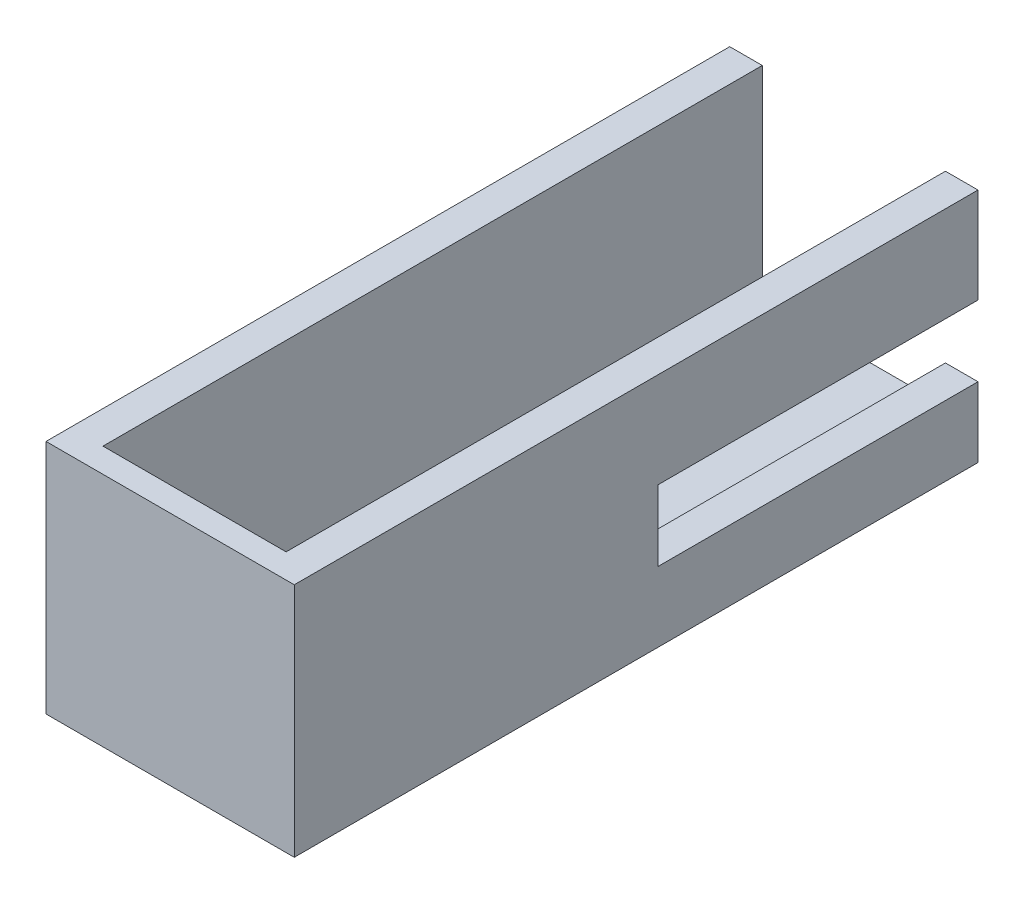
ISO-10303-21;
HEADER;
FILE_DESCRIPTION(('STEP AP214'),'2;1');
FILE_NAME('part.step','',(''),(''),'','','');
FILE_SCHEMA(('AUTOMOTIVE_DESIGN { 1 0 10303 214 1 1 1 1 }'));
ENDSEC;
DATA;
#1=APPLICATION_CONTEXT('core data for automotive mechanical design processes');
#2=APPLICATION_PROTOCOL_DEFINITION('international standard','automotive_design',2000,#1);
#3=PRODUCT_CONTEXT('',#1,'mechanical');
#4=PRODUCT('Part','Part','',(#3));
#5=PRODUCT_RELATED_PRODUCT_CATEGORY('part','',(#4));
#6=PRODUCT_DEFINITION_FORMATION('','',#4);
#7=PRODUCT_DEFINITION_CONTEXT('part definition',#1,'design');
#8=PRODUCT_DEFINITION('design','',#6,#7);
#9=PRODUCT_DEFINITION_SHAPE('','',#8);
#10=(LENGTH_UNIT() NAMED_UNIT(*) SI_UNIT(.MILLI.,.METRE.));
#11=(NAMED_UNIT(*) PLANE_ANGLE_UNIT() SI_UNIT($,.RADIAN.));
#12=(NAMED_UNIT(*) SI_UNIT($,.STERADIAN.) SOLID_ANGLE_UNIT());
#13=UNCERTAINTY_MEASURE_WITH_UNIT(LENGTH_MEASURE(1.E-05),#10,'distance_accuracy_value','');
#14=(GEOMETRIC_REPRESENTATION_CONTEXT(3) GLOBAL_UNCERTAINTY_ASSIGNED_CONTEXT((#13)) GLOBAL_UNIT_ASSIGNED_CONTEXT((#10,
#11,#12)) REPRESENTATION_CONTEXT('',''));
#15=CARTESIAN_POINT('',(0.,0.,0.));
#16=DIRECTION('',(0.,0.,1.));
#17=DIRECTION('',(1.,0.,0.));
#18=AXIS2_PLACEMENT_3D('',#15,#16,#17);
#19=CARTESIAN_POINT('',(12.6513513513514,-25.,42.));
#20=DIRECTION('',(1.,0.,0.));
#21=DIRECTION('',(0.,0.,-1.));
#22=AXIS2_PLACEMENT_3D('',#19,#20,#21);
#23=PLANE('',#22);
#24=DIRECTION('',(0.,0.,-1.));
#25=VECTOR('',#24,1.);
#26=CARTESIAN_POINT('',(12.6513513513514,-11.7079955572935,42.));
#27=LINE('',#26,#25);
#28=CARTESIAN_POINT('',(12.6513513513514,-11.7079955572935,-2.65905185019667));
#29=VERTEX_POINT('',#28);
#30=CARTESIAN_POINT('',(12.6513513513514,-11.7079955572935,-42.));
#31=VERTEX_POINT('',#30);
#32=EDGE_CURVE('E166',#29,#31,#27,.T.);
#33=ORIENTED_EDGE('',*,*,#32,.F.);
#34=DIRECTION('',(0.,1.,0.));
#35=VECTOR('',#34,1.);
#36=CARTESIAN_POINT('',(12.6513513513514,-25.,-2.65905185019667));
#37=LINE('',#36,#35);
#38=CARTESIAN_POINT('',(12.6513513513514,-20.3979955572935,-2.65905185019667));
#39=VERTEX_POINT('',#38);
#40=EDGE_CURVE('E169',#39,#29,#37,.T.);
#41=ORIENTED_EDGE('',*,*,#40,.F.);
#42=DIRECTION('',(0.,0.,1.));
#43=VECTOR('',#42,1.);
#44=CARTESIAN_POINT('',(12.6513513513514,-20.3979955572935,42.));
#45=LINE('',#44,#43);
#46=CARTESIAN_POINT('',(12.6513513513514,-20.3979955572935,-42.));
#47=VERTEX_POINT('',#46);
#48=EDGE_CURVE('E149',#47,#39,#45,.T.);
#49=ORIENTED_EDGE('',*,*,#48,.F.);
#50=DIRECTION('',(0.,-1.,0.));
#51=VECTOR('',#50,1.);
#52=CARTESIAN_POINT('',(12.6513513513514,-25.,-42.));
#53=LINE('',#52,#51);
#54=CARTESIAN_POINT('',(12.6513513513514,-25.,-42.));
#55=VERTEX_POINT('',#54);
#56=EDGE_CURVE('E210',#47,#55,#53,.T.);
#57=ORIENTED_EDGE('',*,*,#56,.T.);
#58=DIRECTION('',(0.,0.,-1.));
#59=VECTOR('',#58,1.);
#60=CARTESIAN_POINT('',(12.6513513513514,-25.,42.));
#61=LINE('',#60,#59);
#62=CARTESIAN_POINT('',(12.6513513513514,-25.,39.));
#63=VERTEX_POINT('',#62);
#64=EDGE_CURVE('E226',#63,#55,#61,.T.);
#65=ORIENTED_EDGE('',*,*,#64,.F.);
#66=DIRECTION('',(0.,-1.,0.));
#67=VECTOR('',#66,1.);
#68=CARTESIAN_POINT('',(12.6513513513514,-25.,39.));
#69=LINE('',#68,#67);
#70=CARTESIAN_POINT('',(12.6513513513514,0.,39.));
#71=VERTEX_POINT('',#70);
#72=EDGE_CURVE('E178',#71,#63,#69,.T.);
#73=ORIENTED_EDGE('',*,*,#72,.F.);
#74=DIRECTION('',(0.,0.,-1.));
#75=VECTOR('',#74,1.);
#76=CARTESIAN_POINT('',(12.6513513513514,0.,42.));
#77=LINE('',#76,#75);
#78=CARTESIAN_POINT('',(12.6513513513514,0.,-42.));
#79=VERTEX_POINT('',#78);
#80=EDGE_CURVE('E230',#71,#79,#77,.T.);
#81=ORIENTED_EDGE('',*,*,#80,.T.);
#82=EDGE_CURVE('E211',#79,#31,#53,.T.);
#83=ORIENTED_EDGE('',*,*,#82,.T.);
#84=EDGE_LOOP('',(#33,#41,#49,#57,#65,#73,#81,#83));
#85=FACE_BOUND('',#84,.T.);
#86=ADVANCED_FACE('F39',(#85),#23,.F.);
#87=CARTESIAN_POINT('',(16.6513513513514,0.,42.));
#88=DIRECTION('',(-1.,0.,0.));
#89=DIRECTION('',(0.,-1.,0.));
#90=AXIS2_PLACEMENT_3D('',#87,#88,#89);
#91=PLANE('',#90);
#92=DIRECTION('',(0.,0.,1.));
#93=VECTOR('',#92,1.);
#94=CARTESIAN_POINT('',(16.6513513513514,-11.7079955572935,42.));
#95=LINE('',#94,#93);
#96=CARTESIAN_POINT('',(16.6513513513514,-11.7079955572935,-42.));
#97=VERTEX_POINT('',#96);
#98=CARTESIAN_POINT('',(16.6513513513514,-11.7079955572935,-2.65905185019667));
#99=VERTEX_POINT('',#98);
#100=EDGE_CURVE('E160',#97,#99,#95,.T.);
#101=ORIENTED_EDGE('',*,*,#100,.F.);
#102=DIRECTION('',(0.,1.,0.));
#103=VECTOR('',#102,1.);
#104=CARTESIAN_POINT('',(16.6513513513514,0.,-42.));
#105=LINE('',#104,#103);
#106=CARTESIAN_POINT('',(16.6513513513514,0.,-42.));
#107=VERTEX_POINT('',#106);
#108=EDGE_CURVE('E203',#97,#107,#105,.T.);
#109=ORIENTED_EDGE('',*,*,#108,.T.);
#110=DIRECTION('',(0.,0.,-1.));
#111=VECTOR('',#110,1.);
#112=CARTESIAN_POINT('',(16.6513513513514,0.,42.));
#113=LINE('',#112,#111);
#114=CARTESIAN_POINT('',(16.6513513513514,0.,42.));
#115=VERTEX_POINT('',#114);
#116=EDGE_CURVE('E233',#115,#107,#113,.T.);
#117=ORIENTED_EDGE('',*,*,#116,.F.);
#118=DIRECTION('',(0.,1.,0.));
#119=VECTOR('',#118,1.);
#120=CARTESIAN_POINT('',(16.6513513513514,0.,42.));
#121=LINE('',#120,#119);
#122=CARTESIAN_POINT('',(16.6513513513514,-29.,42.));
#123=VERTEX_POINT('',#122);
#124=EDGE_CURVE('E190',#123,#115,#121,.T.);
#125=ORIENTED_EDGE('',*,*,#124,.F.);
#126=DIRECTION('',(0.,0.,-1.));
#127=VECTOR('',#126,1.);
#128=CARTESIAN_POINT('',(16.6513513513514,-29.,42.));
#129=LINE('',#128,#127);
#130=CARTESIAN_POINT('',(16.6513513513514,-29.,-42.));
#131=VERTEX_POINT('',#130);
#132=EDGE_CURVE('E236',#123,#131,#129,.T.);
#133=ORIENTED_EDGE('',*,*,#132,.T.);
#134=CARTESIAN_POINT('',(16.6513513513514,-20.3979955572935,-42.));
#135=VERTEX_POINT('',#134);
#136=EDGE_CURVE('E155',#131,#135,#105,.T.);
#137=ORIENTED_EDGE('',*,*,#136,.T.);
#138=DIRECTION('',(0.,0.,-1.));
#139=VECTOR('',#138,1.);
#140=CARTESIAN_POINT('',(16.6513513513514,-20.3979955572935,42.));
#141=LINE('',#140,#139);
#142=CARTESIAN_POINT('',(16.6513513513514,-20.3979955572935,-2.65905185019667));
#143=VERTEX_POINT('',#142);
#144=EDGE_CURVE('E55',#143,#135,#141,.T.);
#145=ORIENTED_EDGE('',*,*,#144,.F.);
#146=DIRECTION('',(0.,-1.,0.));
#147=VECTOR('',#146,1.);
#148=CARTESIAN_POINT('',(16.6513513513514,0.,-2.65905185019667));
#149=LINE('',#148,#147);
#150=EDGE_CURVE('E11',#99,#143,#149,.T.);
#151=ORIENTED_EDGE('',*,*,#150,.F.);
#152=EDGE_LOOP('',(#101,#109,#117,#125,#133,#137,#145,#151));
#153=FACE_BOUND('',#152,.T.);
#154=ADVANCED_FACE('F153',(#153),#91,.F.);
#155=CARTESIAN_POINT('',(0.,0.,-42.));
#156=DIRECTION('',(0.,0.,-1.));
#157=DIRECTION('',(-1.,0.,0.));
#158=AXIS2_PLACEMENT_3D('',#155,#156,#157);
#159=PLANE('',#158);
#160=ORIENTED_EDGE('',*,*,#108,.F.);
#161=DIRECTION('',(-1.,0.,0.));
#162=VECTOR('',#161,1.);
#163=CARTESIAN_POINT('',(0.,-11.7079955572935,-42.));
#164=LINE('',#163,#162);
#165=EDGE_CURVE('E48',#97,#31,#164,.T.);
#166=ORIENTED_EDGE('',*,*,#165,.T.);
#167=ORIENTED_EDGE('',*,*,#82,.F.);
#168=DIRECTION('',(-1.,0.,0.));
#169=VECTOR('',#168,1.);
#170=CARTESIAN_POINT('',(12.6513513513514,0.,-42.));
#171=LINE('',#170,#169);
#172=EDGE_CURVE('E206',#107,#79,#171,.T.);
#173=ORIENTED_EDGE('',*,*,#172,.F.);
#174=EDGE_LOOP('',(#160,#166,#167,#173));
#175=FACE_BOUND('',#174,.T.);
#176=ADVANCED_FACE('F255',(#175),#159,.T.);
#177=ORIENTED_EDGE('',*,*,#56,.F.);
#178=DIRECTION('',(1.,0.,0.));
#179=VECTOR('',#178,1.);
#180=CARTESIAN_POINT('',(0.,-20.3979955572935,-42.));
#181=LINE('',#180,#179);
#182=EDGE_CURVE('E248',#47,#135,#181,.T.);
#183=ORIENTED_EDGE('',*,*,#182,.T.);
#184=ORIENTED_EDGE('',*,*,#136,.F.);
#185=DIRECTION('',(1.,0.,0.));
#186=VECTOR('',#185,1.);
#187=CARTESIAN_POINT('',(16.6513513513514,-29.,-42.));
#188=LINE('',#187,#186);
#189=CARTESIAN_POINT('',(-13.8486486486486,-29.,-42.));
#190=VERTEX_POINT('',#189);
#191=EDGE_CURVE('E199',#190,#131,#188,.T.);
#192=ORIENTED_EDGE('',*,*,#191,.F.);
#193=DIRECTION('',(0.,-1.,0.));
#194=VECTOR('',#193,1.);
#195=CARTESIAN_POINT('',(-13.8486486486486,-29.,-42.));
#196=LINE('',#195,#194);
#197=CARTESIAN_POINT('',(-13.8486486486486,0.,-42.));
#198=VERTEX_POINT('',#197);
#199=EDGE_CURVE('E195',#198,#190,#196,.T.);
#200=ORIENTED_EDGE('',*,*,#199,.F.);
#201=DIRECTION('',(-1.,0.,0.));
#202=VECTOR('',#201,1.);
#203=CARTESIAN_POINT('',(-13.8486486486486,0.,-42.));
#204=LINE('',#203,#202);
#205=CARTESIAN_POINT('',(-9.84864864864864,0.,-42.));
#206=VERTEX_POINT('',#205);
#207=EDGE_CURVE('E181',#206,#198,#204,.T.);
#208=ORIENTED_EDGE('',*,*,#207,.F.);
#209=DIRECTION('',(0.,1.,0.));
#210=VECTOR('',#209,1.);
#211=CARTESIAN_POINT('',(-9.84864864864864,0.,-42.));
#212=LINE('',#211,#210);
#213=CARTESIAN_POINT('',(-9.84864864864863,-25.,-42.));
#214=VERTEX_POINT('',#213);
#215=EDGE_CURVE('E184',#214,#206,#212,.T.);
#216=ORIENTED_EDGE('',*,*,#215,.F.);
#217=DIRECTION('',(-1.,0.,0.));
#218=VECTOR('',#217,1.);
#219=CARTESIAN_POINT('',(-9.84864864864863,-25.,-42.));
#220=LINE('',#219,#218);
#221=EDGE_CURVE('E215',#55,#214,#220,.T.);
#222=ORIENTED_EDGE('',*,*,#221,.F.);
#223=EDGE_LOOP('',(#177,#183,#184,#192,#200,#208,#216,#222));
#224=FACE_BOUND('',#223,.T.);
#225=ADVANCED_FACE('F276',(#224),#159,.T.);
#226=CARTESIAN_POINT('',(-9.84864864864863,-25.,42.));
#227=DIRECTION('',(0.,-1.,0.));
#228=DIRECTION('',(0.,0.,-1.));
#229=AXIS2_PLACEMENT_3D('',#226,#227,#228);
#230=PLANE('',#229);
#231=DIRECTION('',(-1.,0.,0.));
#232=VECTOR('',#231,1.);
#233=CARTESIAN_POINT('',(-9.84864864864863,-25.,39.));
#234=LINE('',#233,#232);
#235=CARTESIAN_POINT('',(-9.84864864864863,-25.,39.));
#236=VERTEX_POINT('',#235);
#237=EDGE_CURVE('E175',#63,#236,#234,.T.);
#238=ORIENTED_EDGE('',*,*,#237,.F.);
#239=ORIENTED_EDGE('',*,*,#64,.T.);
#240=ORIENTED_EDGE('',*,*,#221,.T.);
#241=DIRECTION('',(0.,0.,-1.));
#242=VECTOR('',#241,1.);
#243=CARTESIAN_POINT('',(-9.84864864864863,-25.,42.));
#244=LINE('',#243,#242);
#245=EDGE_CURVE('E223',#236,#214,#244,.T.);
#246=ORIENTED_EDGE('',*,*,#245,.F.);
#247=EDGE_LOOP('',(#238,#239,#240,#246));
#248=FACE_BOUND('',#247,.T.);
#249=ADVANCED_FACE('F273',(#248),#230,.F.);
#250=CARTESIAN_POINT('',(-9.84864864864864,0.,42.));
#251=DIRECTION('',(-1.,0.,0.));
#252=DIRECTION('',(0.,-1.,0.));
#253=AXIS2_PLACEMENT_3D('',#250,#251,#252);
#254=PLANE('',#253);
#255=DIRECTION('',(0.,1.,0.));
#256=VECTOR('',#255,1.);
#257=CARTESIAN_POINT('',(-9.84864864864864,0.,39.));
#258=LINE('',#257,#256);
#259=CARTESIAN_POINT('',(-9.84864864864864,0.,39.));
#260=VERTEX_POINT('',#259);
#261=EDGE_CURVE('E245',#236,#260,#258,.T.);
#262=ORIENTED_EDGE('',*,*,#261,.F.);
#263=ORIENTED_EDGE('',*,*,#245,.T.);
#264=ORIENTED_EDGE('',*,*,#215,.T.);
#265=DIRECTION('',(0.,0.,-1.));
#266=VECTOR('',#265,1.);
#267=CARTESIAN_POINT('',(-9.84864864864864,0.,42.));
#268=LINE('',#267,#266);
#269=EDGE_CURVE('E98',#260,#206,#268,.T.);
#270=ORIENTED_EDGE('',*,*,#269,.F.);
#271=EDGE_LOOP('',(#262,#263,#264,#270));
#272=FACE_BOUND('',#271,.T.);
#273=ADVANCED_FACE('F281',(#272),#254,.F.);
#274=CARTESIAN_POINT('',(-13.8486486486486,-29.,42.));
#275=DIRECTION('',(1.,0.,0.));
#276=DIRECTION('',(0.,1.,0.));
#277=AXIS2_PLACEMENT_3D('',#274,#275,#276);
#278=PLANE('',#277);
#279=DIRECTION('',(0.,0.,-1.));
#280=VECTOR('',#279,1.);
#281=CARTESIAN_POINT('',(-13.8486486486486,0.,42.));
#282=LINE('',#281,#280);
#283=CARTESIAN_POINT('',(-13.8486486486486,0.,42.));
#284=VERTEX_POINT('',#283);
#285=EDGE_CURVE('E242',#284,#198,#282,.T.);
#286=ORIENTED_EDGE('',*,*,#285,.T.);
#287=ORIENTED_EDGE('',*,*,#199,.T.);
#288=DIRECTION('',(0.,0.,-1.));
#289=VECTOR('',#288,1.);
#290=CARTESIAN_POINT('',(-13.8486486486486,-29.,42.));
#291=LINE('',#290,#289);
#292=CARTESIAN_POINT('',(-13.8486486486486,-29.,42.));
#293=VERTEX_POINT('',#292);
#294=EDGE_CURVE('E239',#293,#190,#291,.T.);
#295=ORIENTED_EDGE('',*,*,#294,.F.);
#296=DIRECTION('',(0.,-1.,0.));
#297=VECTOR('',#296,1.);
#298=CARTESIAN_POINT('',(-13.8486486486486,-29.,42.));
#299=LINE('',#298,#297);
#300=EDGE_CURVE('E105',#284,#293,#299,.T.);
#301=ORIENTED_EDGE('',*,*,#300,.F.);
#302=EDGE_LOOP('',(#286,#287,#295,#301));
#303=FACE_BOUND('',#302,.T.);
#304=ADVANCED_FACE('F41',(#303),#278,.F.);
#305=CARTESIAN_POINT('',(16.6513513513514,-29.,42.));
#306=DIRECTION('',(0.,1.,0.));
#307=DIRECTION('',(-1.,0.,0.));
#308=AXIS2_PLACEMENT_3D('',#305,#306,#307);
#309=PLANE('',#308);
#310=ORIENTED_EDGE('',*,*,#294,.T.);
#311=ORIENTED_EDGE('',*,*,#191,.T.);
#312=ORIENTED_EDGE('',*,*,#132,.F.);
#313=DIRECTION('',(1.,0.,0.));
#314=VECTOR('',#313,1.);
#315=CARTESIAN_POINT('',(16.6513513513514,-29.,42.));
#316=LINE('',#315,#314);
#317=EDGE_CURVE('E187',#293,#123,#316,.T.);
#318=ORIENTED_EDGE('',*,*,#317,.F.);
#319=EDGE_LOOP('',(#310,#311,#312,#318));
#320=FACE_BOUND('',#319,.T.);
#321=ADVANCED_FACE('F306',(#320),#309,.F.);
#322=CARTESIAN_POINT('',(12.6513513513514,0.,42.));
#323=DIRECTION('',(0.,-1.,0.));
#324=DIRECTION('',(0.,0.,-1.));
#325=AXIS2_PLACEMENT_3D('',#322,#323,#324);
#326=PLANE('',#325);
#327=ORIENTED_EDGE('',*,*,#116,.T.);
#328=ORIENTED_EDGE('',*,*,#172,.T.);
#329=ORIENTED_EDGE('',*,*,#80,.F.);
#330=DIRECTION('',(-1.,0.,0.));
#331=VECTOR('',#330,1.);
#332=CARTESIAN_POINT('',(-13.8486486486486,0.,39.));
#333=LINE('',#332,#331);
#334=EDGE_CURVE('E172',#71,#260,#333,.T.);
#335=ORIENTED_EDGE('',*,*,#334,.T.);
#336=ORIENTED_EDGE('',*,*,#269,.T.);
#337=ORIENTED_EDGE('',*,*,#207,.T.);
#338=ORIENTED_EDGE('',*,*,#285,.F.);
#339=DIRECTION('',(-1.,0.,0.));
#340=VECTOR('',#339,1.);
#341=CARTESIAN_POINT('',(-13.8486486486486,0.,42.));
#342=LINE('',#341,#340);
#343=EDGE_CURVE('E64',#115,#284,#342,.T.);
#344=ORIENTED_EDGE('',*,*,#343,.F.);
#345=EDGE_LOOP('',(#327,#328,#329,#335,#336,#337,#338,#344));
#346=FACE_BOUND('',#345,.T.);
#347=ADVANCED_FACE('F263',(#346),#326,.F.);
#348=CARTESIAN_POINT('',(0.,0.,42.));
#349=DIRECTION('',(0.,0.,-1.));
#350=DIRECTION('',(-1.,0.,0.));
#351=AXIS2_PLACEMENT_3D('',#348,#349,#350);
#352=PLANE('',#351);
#353=ORIENTED_EDGE('',*,*,#343,.T.);
#354=ORIENTED_EDGE('',*,*,#300,.T.);
#355=ORIENTED_EDGE('',*,*,#317,.T.);
#356=ORIENTED_EDGE('',*,*,#124,.T.);
#357=EDGE_LOOP('',(#353,#354,#355,#356));
#358=FACE_BOUND('',#357,.T.);
#359=ADVANCED_FACE('F285',(#358),#352,.F.);
#360=CARTESIAN_POINT('',(0.,0.,39.));
#361=DIRECTION('',(0.,0.,1.));
#362=DIRECTION('',(1.,0.,0.));
#363=AXIS2_PLACEMENT_3D('',#360,#361,#362);
#364=PLANE('',#363);
#365=ORIENTED_EDGE('',*,*,#334,.F.);
#366=ORIENTED_EDGE('',*,*,#72,.T.);
#367=ORIENTED_EDGE('',*,*,#237,.T.);
#368=ORIENTED_EDGE('',*,*,#261,.T.);
#369=EDGE_LOOP('',(#365,#366,#367,#368));
#370=FACE_BOUND('',#369,.T.);
#371=ADVANCED_FACE('F283',(#370),#364,.F.);
#372=CARTESIAN_POINT('',(30.,-20.3979955572935,-2.65905185019667));
#373=DIRECTION('',(0.,0.,-1.));
#374=DIRECTION('',(-1.,0.,0.));
#375=AXIS2_PLACEMENT_3D('',#372,#373,#374);
#376=PLANE('',#375);
#377=ORIENTED_EDGE('',*,*,#40,.T.);
#378=DIRECTION('',(-1.,0.,0.));
#379=VECTOR('',#378,1.);
#380=CARTESIAN_POINT('',(30.,-11.7079955572935,-2.65905185019667));
#381=LINE('',#380,#379);
#382=EDGE_CURVE('E144',#99,#29,#381,.T.);
#383=ORIENTED_EDGE('',*,*,#382,.F.);
#384=ORIENTED_EDGE('',*,*,#150,.T.);
#385=DIRECTION('',(-1.,0.,0.));
#386=VECTOR('',#385,1.);
#387=CARTESIAN_POINT('',(30.,-20.3979955572935,-2.65905185019667));
#388=LINE('',#387,#386);
#389=EDGE_CURVE('E141',#143,#39,#388,.T.);
#390=ORIENTED_EDGE('',*,*,#389,.T.);
#391=EDGE_LOOP('',(#377,#383,#384,#390));
#392=FACE_BOUND('',#391,.T.);
#393=ADVANCED_FACE('F140',(#392),#376,.T.);
#394=CARTESIAN_POINT('',(30.,-11.7079955572935,-2.65905185019667));
#395=DIRECTION('',(0.,-1.,0.));
#396=DIRECTION('',(0.,0.,-1.));
#397=AXIS2_PLACEMENT_3D('',#394,#395,#396);
#398=PLANE('',#397);
#399=ORIENTED_EDGE('',*,*,#32,.T.);
#400=ORIENTED_EDGE('',*,*,#165,.F.);
#401=ORIENTED_EDGE('',*,*,#100,.T.);
#402=ORIENTED_EDGE('',*,*,#382,.T.);
#403=EDGE_LOOP('',(#399,#400,#401,#402));
#404=FACE_BOUND('',#403,.T.);
#405=ADVANCED_FACE('F291',(#404),#398,.T.);
#406=CARTESIAN_POINT('',(30.,-20.3979955572935,-2.65905185019667));
#407=DIRECTION('',(0.,1.,0.));
#408=DIRECTION('',(0.,0.,1.));
#409=AXIS2_PLACEMENT_3D('',#406,#407,#408);
#410=PLANE('',#409);
#411=ORIENTED_EDGE('',*,*,#48,.T.);
#412=ORIENTED_EDGE('',*,*,#389,.F.);
#413=ORIENTED_EDGE('',*,*,#144,.T.);
#414=ORIENTED_EDGE('',*,*,#182,.F.);
#415=EDGE_LOOP('',(#411,#412,#413,#414));
#416=FACE_BOUND('',#415,.T.);
#417=ADVANCED_FACE('F147',(#416),#410,.T.);
#418=CLOSED_SHELL('',(#86,#154,#176,#225,#249,#273,#304,#321,#347,#359,#371,#393,#405,#417));
#419=MANIFOLD_SOLID_BREP('B2',#418);
#420=ADVANCED_BREP_SHAPE_REPRESENTATION('',(#18,#419),#14);
#421=SHAPE_DEFINITION_REPRESENTATION(#9,#420);
ENDSEC;
END-ISO-10303-21;
